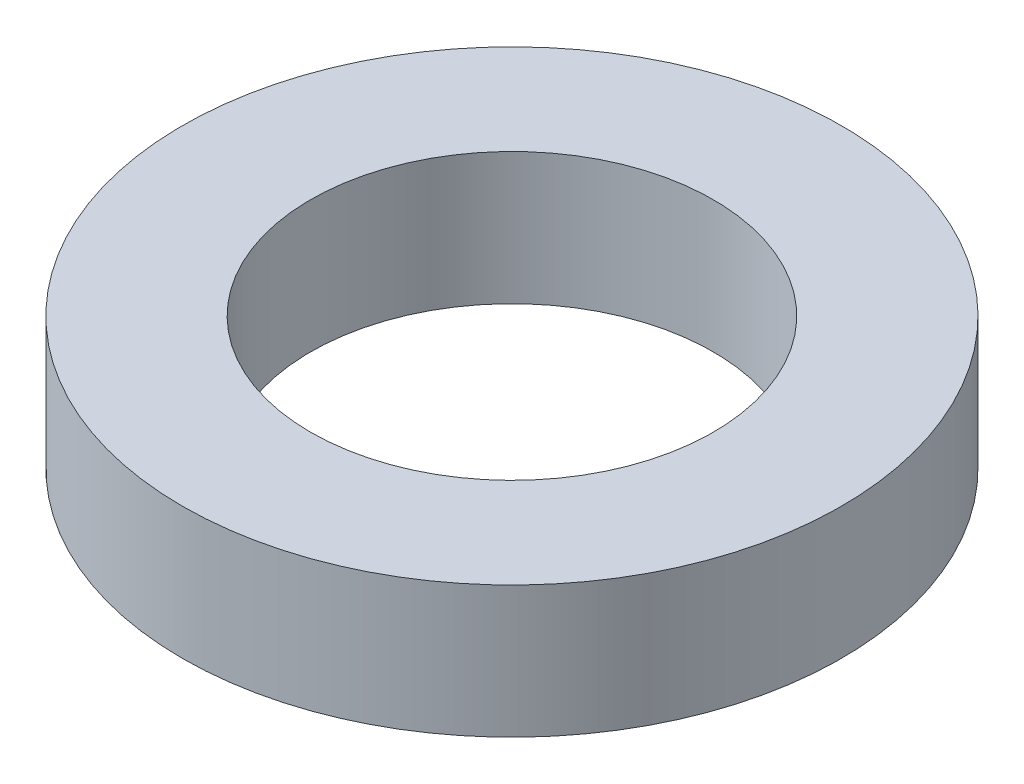
ISO-10303-21;
HEADER;
FILE_DESCRIPTION(('STEP AP214'),'2;1');
FILE_NAME('part.step','',(''),(''),'','','');
FILE_SCHEMA(('AUTOMOTIVE_DESIGN { 1 0 10303 214 1 1 1 1 }'));
ENDSEC;
DATA;
#1=APPLICATION_CONTEXT('core data for automotive mechanical design processes');
#2=APPLICATION_PROTOCOL_DEFINITION('international standard','automotive_design',2000,#1);
#3=PRODUCT_CONTEXT('',#1,'mechanical');
#4=PRODUCT('Part','Part','',(#3));
#5=PRODUCT_RELATED_PRODUCT_CATEGORY('part','',(#4));
#6=PRODUCT_DEFINITION_FORMATION('','',#4);
#7=PRODUCT_DEFINITION_CONTEXT('part definition',#1,'design');
#8=PRODUCT_DEFINITION('design','',#6,#7);
#9=PRODUCT_DEFINITION_SHAPE('','',#8);
#10=(LENGTH_UNIT() NAMED_UNIT(*) SI_UNIT(.MILLI.,.METRE.));
#11=(NAMED_UNIT(*) PLANE_ANGLE_UNIT() SI_UNIT($,.RADIAN.));
#12=(NAMED_UNIT(*) SI_UNIT($,.STERADIAN.) SOLID_ANGLE_UNIT());
#13=UNCERTAINTY_MEASURE_WITH_UNIT(LENGTH_MEASURE(1.E-05),#10,'distance_accuracy_value','');
#14=(GEOMETRIC_REPRESENTATION_CONTEXT(3) GLOBAL_UNCERTAINTY_ASSIGNED_CONTEXT((#13)) GLOBAL_UNIT_ASSIGNED_CONTEXT((#10,
#11,#12)) REPRESENTATION_CONTEXT('',''));
#15=CARTESIAN_POINT('',(0.,0.,0.));
#16=DIRECTION('',(0.,0.,1.));
#17=DIRECTION('',(1.,0.,0.));
#18=AXIS2_PLACEMENT_3D('',#15,#16,#17);
#19=CARTESIAN_POINT('',(0.,18.,0.));
#20=DIRECTION('',(0.,-1.,0.));
#21=DIRECTION('',(0.,0.,-1.));
#22=AXIS2_PLACEMENT_3D('',#19,#20,#21);
#23=CYLINDRICAL_SURFACE('',#22,45.);
#24=CARTESIAN_POINT('',(0.,18.,0.));
#25=DIRECTION('',(0.,1.,0.));
#26=DIRECTION('',(0.,0.,1.));
#27=AXIS2_PLACEMENT_3D('',#24,#25,#26);
#28=CIRCLE('',#27,45.);
#29=CARTESIAN_POINT('',(0.,18.,45.));
#30=VERTEX_POINT('',#29);
#31=EDGE_CURVE('E10',#30,#30,#28,.T.);
#32=ORIENTED_EDGE('',*,*,#31,.F.);
#33=EDGE_LOOP('',(#32));
#34=FACE_BOUND('',#33,.T.);
#35=CARTESIAN_POINT('',(0.,0.,0.));
#36=DIRECTION('',(0.,1.,0.));
#37=DIRECTION('',(0.,0.,1.));
#38=AXIS2_PLACEMENT_3D('',#35,#36,#37);
#39=CIRCLE('',#38,45.);
#40=CARTESIAN_POINT('',(0.,0.,45.));
#41=VERTEX_POINT('',#40);
#42=EDGE_CURVE('E37',#41,#41,#39,.T.);
#43=ORIENTED_EDGE('',*,*,#42,.T.);
#44=EDGE_LOOP('',(#43));
#45=FACE_BOUND('',#44,.T.);
#46=ADVANCED_FACE('F40',(#34,#45),#23,.T.);
#47=CARTESIAN_POINT('',(0.,18.,0.));
#48=DIRECTION('',(0.,1.,0.));
#49=DIRECTION('',(0.,0.,1.));
#50=AXIS2_PLACEMENT_3D('',#47,#48,#49);
#51=PLANE('',#50);
#52=CARTESIAN_POINT('',(0.,18.,0.));
#53=DIRECTION('',(0.,1.,0.));
#54=DIRECTION('',(0.,0.,1.));
#55=AXIS2_PLACEMENT_3D('',#52,#53,#54);
#56=CIRCLE('',#55,27.5);
#57=CARTESIAN_POINT('',(0.,18.,27.5));
#58=VERTEX_POINT('',#57);
#59=EDGE_CURVE('E50',#58,#58,#56,.T.);
#60=ORIENTED_EDGE('',*,*,#59,.F.);
#61=EDGE_LOOP('',(#60));
#62=FACE_BOUND('',#61,.T.);
#63=ORIENTED_EDGE('',*,*,#31,.T.);
#64=EDGE_LOOP('',(#63));
#65=FACE_BOUND('',#64,.T.);
#66=ADVANCED_FACE('F59',(#62,#65),#51,.T.);
#67=CARTESIAN_POINT('',(0.,0.,0.));
#68=DIRECTION('',(0.,1.,0.));
#69=DIRECTION('',(0.,0.,1.));
#70=AXIS2_PLACEMENT_3D('',#67,#68,#69);
#71=PLANE('',#70);
#72=CARTESIAN_POINT('',(0.,0.,0.));
#73=DIRECTION('',(0.,1.,0.));
#74=DIRECTION('',(0.,0.,1.));
#75=AXIS2_PLACEMENT_3D('',#72,#73,#74);
#76=CIRCLE('',#75,27.5);
#77=CARTESIAN_POINT('',(0.,0.,27.5));
#78=VERTEX_POINT('',#77);
#79=EDGE_CURVE('E47',#78,#78,#76,.T.);
#80=ORIENTED_EDGE('',*,*,#79,.T.);
#81=EDGE_LOOP('',(#80));
#82=FACE_BOUND('',#81,.T.);
#83=ORIENTED_EDGE('',*,*,#42,.F.);
#84=EDGE_LOOP('',(#83));
#85=FACE_BOUND('',#84,.T.);
#86=ADVANCED_FACE('F58',(#82,#85),#71,.F.);
#87=CARTESIAN_POINT('',(0.,18.,0.));
#88=DIRECTION('',(0.,-1.,0.));
#89=DIRECTION('',(0.,0.,-1.));
#90=AXIS2_PLACEMENT_3D('',#87,#88,#89);
#91=CYLINDRICAL_SURFACE('',#90,27.5);
#92=ORIENTED_EDGE('',*,*,#59,.T.);
#93=EDGE_LOOP('',(#92));
#94=FACE_BOUND('',#93,.T.);
#95=ORIENTED_EDGE('',*,*,#79,.F.);
#96=EDGE_LOOP('',(#95));
#97=FACE_BOUND('',#96,.T.);
#98=ADVANCED_FACE('F54',(#94,#97),#91,.F.);
#99=CLOSED_SHELL('',(#46,#66,#86,#98));
#100=MANIFOLD_SOLID_BREP('B2',#99);
#101=ADVANCED_BREP_SHAPE_REPRESENTATION('',(#18,#100),#14);
#102=SHAPE_DEFINITION_REPRESENTATION(#9,#101);
ENDSEC;
END-ISO-10303-21;
